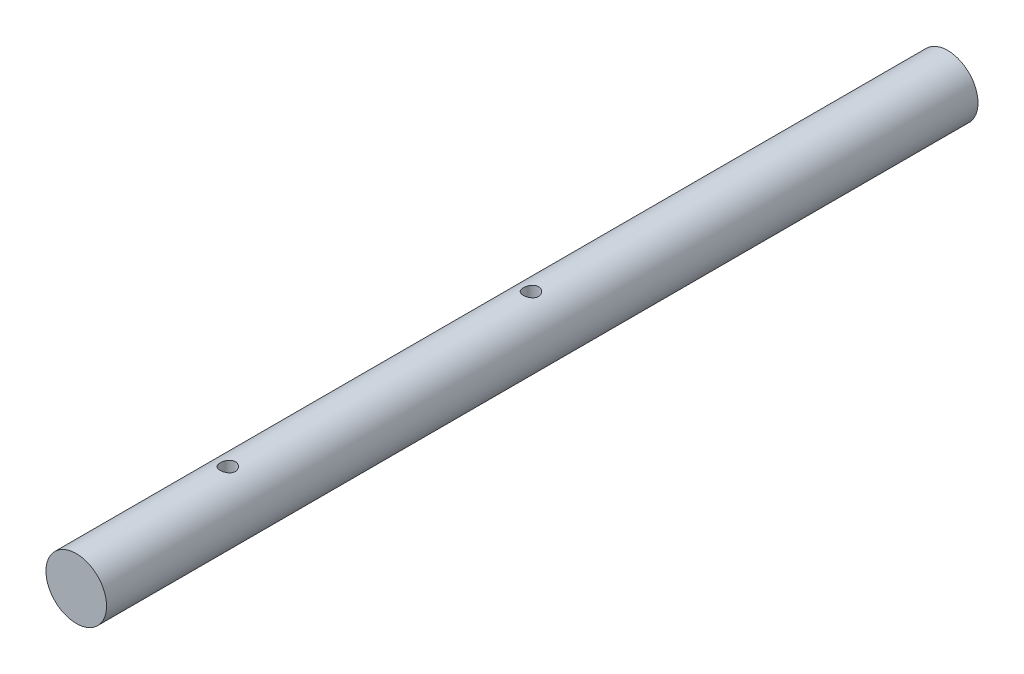
ISO-10303-21;
HEADER;
FILE_DESCRIPTION(('STEP AP214'),'2;1');
FILE_NAME('part.step','',(''),(''),'','','');
FILE_SCHEMA(('AUTOMOTIVE_DESIGN { 1 0 10303 214 1 1 1 1 }'));
ENDSEC;
DATA;
#1=APPLICATION_CONTEXT('core data for automotive mechanical design processes');
#2=APPLICATION_PROTOCOL_DEFINITION('international standard','automotive_design',2000,#1);
#3=PRODUCT_CONTEXT('',#1,'mechanical');
#4=PRODUCT('Part','Part','',(#3));
#5=PRODUCT_RELATED_PRODUCT_CATEGORY('part','',(#4));
#6=PRODUCT_DEFINITION_FORMATION('','',#4);
#7=PRODUCT_DEFINITION_CONTEXT('part definition',#1,'design');
#8=PRODUCT_DEFINITION('design','',#6,#7);
#9=PRODUCT_DEFINITION_SHAPE('','',#8);
#10=(LENGTH_UNIT() NAMED_UNIT(*) SI_UNIT(.MILLI.,.METRE.));
#11=(NAMED_UNIT(*) PLANE_ANGLE_UNIT() SI_UNIT($,.RADIAN.));
#12=(NAMED_UNIT(*) SI_UNIT($,.STERADIAN.) SOLID_ANGLE_UNIT());
#13=UNCERTAINTY_MEASURE_WITH_UNIT(LENGTH_MEASURE(1.E-05),#10,'distance_accuracy_value','');
#14=(GEOMETRIC_REPRESENTATION_CONTEXT(3) GLOBAL_UNCERTAINTY_ASSIGNED_CONTEXT((#13)) GLOBAL_UNIT_ASSIGNED_CONTEXT((#10,
#11,#12)) REPRESENTATION_CONTEXT('',''));
#15=CARTESIAN_POINT('',(0.,0.,0.));
#16=DIRECTION('',(0.,0.,1.));
#17=DIRECTION('',(1.,0.,0.));
#18=AXIS2_PLACEMENT_3D('',#15,#16,#17);
#19=CARTESIAN_POINT('',(-17.8140607084461,40.7356493123209,230.));
#20=DIRECTION('',(0.,0.,-1.));
#21=DIRECTION('',(-1.,0.,0.));
#22=AXIS2_PLACEMENT_3D('',#19,#20,#21);
#23=CYLINDRICAL_SURFACE('',#22,8.);
#24=CARTESIAN_POINT('',(-17.8140607084461,40.7356493123209,230.));
#25=DIRECTION('',(0.,0.,1.));
#26=DIRECTION('',(1.,0.,0.));
#27=AXIS2_PLACEMENT_3D('',#24,#25,#26);
#28=CIRCLE('',#27,8.);
#29=CARTESIAN_POINT('',(-9.81406070844613,40.7356493123209,230.));
#30=VERTEX_POINT('',#29);
#31=EDGE_CURVE('E12',#30,#30,#28,.T.);
#32=ORIENTED_EDGE('',*,*,#31,.F.);
#33=EDGE_LOOP('',(#32));
#34=FACE_BOUND('',#33,.T.);
#35=CARTESIAN_POINT('',(-17.8140607084461,40.7356493123209,0.));
#36=DIRECTION('',(0.,0.,1.));
#37=DIRECTION('',(1.,0.,0.));
#38=AXIS2_PLACEMENT_3D('',#35,#36,#37);
#39=CIRCLE('',#38,8.);
#40=CARTESIAN_POINT('',(-9.81406070844613,40.7356493123209,0.));
#41=VERTEX_POINT('',#40);
#42=EDGE_CURVE('E55',#41,#41,#39,.T.);
#43=ORIENTED_EDGE('',*,*,#42,.T.);
#44=EDGE_LOOP('',(#43));
#45=FACE_BOUND('',#44,.T.);
#46=CARTESIAN_POINT('',(-17.8140607084461,32.7356493123209,188.));
#47=CARTESIAN_POINT('',(-17.7035592568865,32.7356511807474,188.000003100984));
#48=CARTESIAN_POINT('',(-17.5930231646718,32.7379616038965,188.009188734365));
#49=CARTESIAN_POINT('',(-17.3751189434187,32.7469544612556,188.045633535076));
#50=CARTESIAN_POINT('',(-17.2677526459518,32.7536393733879,188.07290294605));
#51=CARTESIAN_POINT('',(-17.0593662122027,32.7706409612271,188.144585671283));
#52=CARTESIAN_POINT('',(-16.9583386238728,32.7809532744268,188.188978398287));
#53=CARTESIAN_POINT('',(-16.7651645325735,32.8041113948859,188.293575186726));
#54=CARTESIAN_POINT('',(-16.6730183293144,32.8169572875988,188.353779781492));
#55=CARTESIAN_POINT('',(-16.4983248053782,32.844083797765,188.489601052872));
#56=CARTESIAN_POINT('',(-16.4159864550314,32.8583865503459,188.565482099945));
#57=CARTESIAN_POINT('',(-16.2650621388417,32.8866677107484,188.729936273212));
#58=CARTESIAN_POINT('',(-16.1964777258472,32.9006460817893,188.818510830596));
#59=CARTESIAN_POINT('',(-16.0740253180475,32.9269189696786,189.007460302316));
#60=CARTESIAN_POINT('',(-16.0203910872126,32.9391853861234,189.107990974412));
#61=CARTESIAN_POINT('',(-15.9308648303785,32.9603227147473,189.316997882213));
#62=CARTESIAN_POINT('',(-15.8949699678593,32.9691941697286,189.425472844443));
#63=CARTESIAN_POINT('',(-15.8426542593731,32.9823096230366,189.644991330936));
#64=CARTESIAN_POINT('',(-15.8258576840034,32.9866427656941,189.755939861384));
#65=CARTESIAN_POINT('',(-15.8110450083576,32.9904578128597,189.979158091999));
#66=CARTESIAN_POINT('',(-15.8130258526886,32.9899405066152,190.091427574256));
#67=CARTESIAN_POINT('',(-15.8354120089265,32.9841932387633,190.311221076994));
#68=CARTESIAN_POINT('',(-15.8553695881919,32.979077805557,190.418794161954));
#69=CARTESIAN_POINT('',(-15.9124284592421,32.9648931833733,190.629014734548));
#70=CARTESIAN_POINT('',(-15.9495309723536,32.955823712731,190.731661870705));
#71=CARTESIAN_POINT('',(-16.0402080711965,32.9346477935788,190.930317355003));
#72=CARTESIAN_POINT('',(-16.0939451521356,32.9225116127233,191.026248229053));
#73=CARTESIAN_POINT('',(-16.2162523404262,32.896586501041,191.207891613009));
#74=CARTESIAN_POINT('',(-16.2848250433677,32.8827972811925,191.293602330756));
#75=CARTESIAN_POINT('',(-16.4371761422045,32.854637571789,191.454938154259));
#76=CARTESIAN_POINT('',(-16.521332364225,32.8402617192809,191.530205986748));
#77=CARTESIAN_POINT('',(-16.7012448184412,32.8129031046041,191.665628323285));
#78=CARTESIAN_POINT('',(-16.7970014048355,32.7999203849954,191.725782365685));
#79=CARTESIAN_POINT('',(-16.9979061902043,32.7767462177317,191.829400781633));
#80=CARTESIAN_POINT('',(-17.1030855175013,32.7665645106179,191.872807120339));
#81=CARTESIAN_POINT('',(-17.3195593642556,32.750210419102,191.941223074279));
#82=CARTESIAN_POINT('',(-17.4308527095788,32.7440372677971,191.966236208558));
#83=CARTESIAN_POINT('',(-17.6533407479261,32.7365093220359,191.996610087412));
#84=CARTESIAN_POINT('',(-17.7644650817952,32.7350352655438,192.0024573681));
#85=CARTESIAN_POINT('',(-17.9861045415148,32.7367319147949,191.995667997259));
#86=CARTESIAN_POINT('',(-18.0966197213056,32.7399022024296,191.983033009601));
#87=CARTESIAN_POINT('',(-18.3122130668148,32.7504548972895,191.940038788811));
#88=CARTESIAN_POINT('',(-18.4173475337378,32.7577741898434,191.909944982031));
#89=CARTESIAN_POINT('',(-18.6210704317161,32.7757998905324,191.833190554629));
#90=CARTESIAN_POINT('',(-18.7196582004896,32.7865066407223,191.786528260916));
#91=CARTESIAN_POINT('',(-18.9094248876859,32.8104052066367,191.677018494834));
#92=CARTESIAN_POINT('',(-19.0004412975606,32.8236377474284,191.613898516804));
#93=CARTESIAN_POINT('',(-19.1707628599705,32.8510558564886,191.473613454937));
#94=CARTESIAN_POINT('',(-19.2500659870768,32.8652415889648,191.396445947177));
#95=CARTESIAN_POINT('',(-19.3967147992098,32.8933965528439,191.227997385541));
#96=CARTESIAN_POINT('',(-19.4637191986088,32.9073519231571,191.136416395997));
#97=CARTESIAN_POINT('',(-19.5814083871297,32.9330776006244,190.943023154046));
#98=CARTESIAN_POINT('',(-19.6320939006567,32.9448480047605,190.841211356054));
#99=CARTESIAN_POINT('',(-19.7153292692585,32.9647413825253,190.630792370116));
#100=CARTESIAN_POINT('',(-19.7479865706516,32.9728859084288,190.522229828875));
#101=CARTESIAN_POINT('',(-19.7945215883845,32.9846260577851,190.300920482814));
#102=CARTESIAN_POINT('',(-19.808403411751,32.9882226760551,190.188174598623));
#103=CARTESIAN_POINT('',(-19.8167788288915,32.9903839629348,189.965171968193));
#104=CARTESIAN_POINT('',(-19.8118179054863,32.9890902092774,189.854936753167));
#105=CARTESIAN_POINT('',(-19.78389707953,32.981943858883,189.636928148443));
#106=CARTESIAN_POINT('',(-19.7609375386952,32.9760913537628,189.529154709315));
#107=CARTESIAN_POINT('',(-19.6979691343699,32.9605658365512,189.319722054579));
#108=CARTESIAN_POINT('',(-19.6580625813533,32.9509157758367,189.21803025968));
#109=CARTESIAN_POINT('',(-19.5624139265862,32.9288792359898,189.022712823048));
#110=CARTESIAN_POINT('',(-19.5066696284917,32.9164923773772,188.929088302417));
#111=CARTESIAN_POINT('',(-19.379217706629,32.8899741888074,188.749927161331));
#112=CARTESIAN_POINT('',(-19.3071315923291,32.8758057812308,188.664665235435));
#113=CARTESIAN_POINT('',(-19.1497798700324,32.8475422823704,188.507270606939));
#114=CARTESIAN_POINT('',(-19.0645111367943,32.8334472092934,188.435141026516));
#115=CARTESIAN_POINT('',(-18.8813508240496,32.8066139036854,188.304784921914));
#116=CARTESIAN_POINT('',(-18.783258604868,32.7939048674426,188.246833848438));
#117=CARTESIAN_POINT('',(-18.5784154544601,32.771583645986,188.148336716079));
#118=CARTESIAN_POINT('',(-18.4716707930285,32.7619692429905,188.107778185802));
#119=CARTESIAN_POINT('',(-18.2732743794374,32.748341851447,188.05123755956));
#120=CARTESIAN_POINT('',(-18.1825676029902,32.7436148449517,188.032065009262));
#121=CARTESIAN_POINT('',(-17.9992688038278,32.7372679092282,188.006445408504));
#122=CARTESIAN_POINT('',(-17.9066769234363,32.7356477463089,187.999997400926));
#123=CARTESIAN_POINT('',(-17.8140607084461,32.7356493123209,188.));
#124=B_SPLINE_CURVE_WITH_KNOTS('',3,(#46,#47,#48,#49,#50,#51,#52,#53,#54,#55,#56,#57,#58,#59,
#60,#61,#62,#63,#64,#65,#66,#67,#68,#69,#70,#71,#72,#73,#74,#75,#76,#77,#78,#79,#80,#81,#82,#83,
#84,#85,#86,#87,#88,#89,#90,#91,#92,#93,#94,#95,#96,#97,#98,#99,#100,#101,#102,#103,#104,#105,
#106,#107,#108,#109,#110,#111,#112,#113,#114,#115,#116,#117,#118,#119,#120,#121,#122,#123),
.UNSPECIFIED.,.T.,.F.,(4,2,2,2,2,2,2,2,2,2,2,2,2,2,2,2,2,2,2,2,2,2,2,2,2,2,2,2,2,2,2,2,2,2,2,2,
2,2,4),(0.,0.331164949962527,0.662517650351869,0.993473203048152,1.32443992022577,
1.66152580582854,1.99864972773417,2.34078196727745,2.68285948225828,3.01808393468097,
3.35325384154692,3.68029996013788,4.00736937959147,4.33774037169601,4.66816921119315,
5.00802001296456,5.34788119415426,5.68890972016583,6.02987298255954,6.36211078603465,
6.69431868154755,7.02160366023148,7.34892169767485,7.682047834249,8.0152315068179,
8.35659345610402,8.69794025003778,9.03723006156481,9.37644564340978,9.70591707202587,
10.0353818794581,10.362885340837,10.6904342418697,11.0265276855098,11.3627009303166,
11.7049624733722,12.046978184329,12.324563239273,12.6021274139515),.UNSPECIFIED.);
#125=CARTESIAN_POINT('',(-17.8140607084461,32.7356493123209,188.));
#126=VERTEX_POINT('',#125);
#127=EDGE_CURVE('E62',#126,#126,#124,.T.);
#128=ORIENTED_EDGE('',*,*,#127,.F.);
#129=EDGE_LOOP('',(#128));
#130=FACE_BOUND('',#129,.T.);
#131=CARTESIAN_POINT('',(-17.8140607084461,48.7356493123209,188.));
#132=CARTESIAN_POINT('',(-17.9245621600058,48.7356474438944,188.000003100984));
#133=CARTESIAN_POINT('',(-18.0350982522205,48.7333370207452,188.009188734365));
#134=CARTESIAN_POINT('',(-18.2530024734735,48.7243441633861,188.045633535076));
#135=CARTESIAN_POINT('',(-18.3603687709405,48.7176592512539,188.07290294605));
#136=CARTESIAN_POINT('',(-18.5687552046896,48.7006576634146,188.144585671283));
#137=CARTESIAN_POINT('',(-18.6697827930195,48.690345350215,188.188978398287));
#138=CARTESIAN_POINT('',(-18.8629568843187,48.6671872297558,188.293575186726));
#139=CARTESIAN_POINT('',(-18.9551030875778,48.654341337043,188.353779781492));
#140=CARTESIAN_POINT('',(-19.129796611514,48.6272148268768,188.489601052872));
#141=CARTESIAN_POINT('',(-19.2121349618609,48.6129120742959,188.565482099945));
#142=CARTESIAN_POINT('',(-19.3630592780506,48.5846309138934,188.729936273212));
#143=CARTESIAN_POINT('',(-19.4316436910451,48.5706525428524,188.818510830596));
#144=CARTESIAN_POINT('',(-19.5540960988448,48.5443796549631,189.007460302316));
#145=CARTESIAN_POINT('',(-19.6077303296797,48.5321132385184,189.107990974412));
#146=CARTESIAN_POINT('',(-19.6972565865138,48.5109759098944,189.316997882213));
#147=CARTESIAN_POINT('',(-19.733151449033,48.5021044549131,189.425472844443));
#148=CARTESIAN_POINT('',(-19.7854671575192,48.4889890016052,189.644991330936));
#149=CARTESIAN_POINT('',(-19.8022637328889,48.4846558589477,189.755939861384));
#150=CARTESIAN_POINT('',(-19.8170764085347,48.4808408117821,189.979158091999));
#151=CARTESIAN_POINT('',(-19.8150955642036,48.4813581180266,190.091427574256));
#152=CARTESIAN_POINT('',(-19.7927094079657,48.4871053858784,190.311221076994));
#153=CARTESIAN_POINT('',(-19.7727518287003,48.4922208190848,190.418794161954));
#154=CARTESIAN_POINT('',(-19.7156929576501,48.5064054412685,190.629014734548));
#155=CARTESIAN_POINT('',(-19.6785904445387,48.5154749119107,190.731661870705));
#156=CARTESIAN_POINT('',(-19.5879133456957,48.536650831063,190.930317355003));
#157=CARTESIAN_POINT('',(-19.5341762647567,48.5487870119184,191.026248229053));
#158=CARTESIAN_POINT('',(-19.4118690764661,48.5747121236008,191.207891613009));
#159=CARTESIAN_POINT('',(-19.3432963735246,48.5885013434493,191.293602330756));
#160=CARTESIAN_POINT('',(-19.1909452746877,48.6166610528528,191.454938154259));
#161=CARTESIAN_POINT('',(-19.1067890526673,48.6310369053609,191.530205986748));
#162=CARTESIAN_POINT('',(-18.9268765984511,48.6583955200376,191.665628323285));
#163=CARTESIAN_POINT('',(-18.8311200120567,48.6713782396463,191.725782365685));
#164=CARTESIAN_POINT('',(-18.630215226688,48.6945524069101,191.829400781633));
#165=CARTESIAN_POINT('',(-18.525035899391,48.7047341140239,191.872807120339));
#166=CARTESIAN_POINT('',(-18.3085620526366,48.7210882055398,191.941223074279));
#167=CARTESIAN_POINT('',(-18.1972687073134,48.7272613568446,191.966236208558));
#168=CARTESIAN_POINT('',(-17.9747806689662,48.7347893026059,191.996610087412));
#169=CARTESIAN_POINT('',(-17.8636563350971,48.7362633590979,192.0024573681));
#170=CARTESIAN_POINT('',(-17.6420168753775,48.7345667098469,191.995667997259));
#171=CARTESIAN_POINT('',(-17.5315016955867,48.7313964222122,191.983033009601));
#172=CARTESIAN_POINT('',(-17.3159083500775,48.7208437273523,191.940038788811));
#173=CARTESIAN_POINT('',(-17.2107738831544,48.7135244347984,191.909944982031));
#174=CARTESIAN_POINT('',(-17.0070509851761,48.6954987341093,191.833190554629));
#175=CARTESIAN_POINT('',(-16.9084632164026,48.6847919839194,191.786528260916));
#176=CARTESIAN_POINT('',(-16.7186965292063,48.660893418005,191.677018494834));
#177=CARTESIAN_POINT('',(-16.6276801193317,48.6476608772133,191.613898516804));
#178=CARTESIAN_POINT('',(-16.4573585569218,48.6202427681531,191.473613454937));
#179=CARTESIAN_POINT('',(-16.3780554298154,48.6060570356769,191.396445947177));
#180=CARTESIAN_POINT('',(-16.2314066176825,48.5779020717978,191.227997385541));
#181=CARTESIAN_POINT('',(-16.1644022182834,48.5639467014846,191.136416395997));
#182=CARTESIAN_POINT('',(-16.0467130297625,48.5382210240174,190.943023154046));
#183=CARTESIAN_POINT('',(-15.9960275162355,48.5264506198812,190.841211356054));
#184=CARTESIAN_POINT('',(-15.9127921476337,48.5065572421164,190.630792370116));
#185=CARTESIAN_POINT('',(-15.8801348462407,48.4984127162129,190.522229828875));
#186=CARTESIAN_POINT('',(-15.8335998285077,48.4866725668566,190.300920482814));
#187=CARTESIAN_POINT('',(-15.8197180051412,48.4830759485867,190.188174598623));
#188=CARTESIAN_POINT('',(-15.8113425880008,48.480914661707,189.965171968193));
#189=CARTESIAN_POINT('',(-15.816303511406,48.4822084153644,189.854936753167));
#190=CARTESIAN_POINT('',(-15.8442243373623,48.4893547657588,189.636928148443));
#191=CARTESIAN_POINT('',(-15.8671838781971,48.495207270879,189.529154709315));
#192=CARTESIAN_POINT('',(-15.9301522825224,48.5107327880905,189.319722054579));
#193=CARTESIAN_POINT('',(-15.970058835539,48.520382848805,189.21803025968));
#194=CARTESIAN_POINT('',(-16.065707490306,48.5424193886519,189.022712823048));
#195=CARTESIAN_POINT('',(-16.1214517884005,48.5548062472645,188.929088302417));
#196=CARTESIAN_POINT('',(-16.2489037102633,48.5813244358344,188.749927161331));
#197=CARTESIAN_POINT('',(-16.3209898245631,48.595492843411,188.664665235435));
#198=CARTESIAN_POINT('',(-16.4783415468598,48.6237563422713,188.507270606939));
#199=CARTESIAN_POINT('',(-16.5636102800979,48.6378514153483,188.435141026516));
#200=CARTESIAN_POINT('',(-16.7467705928427,48.6646847209564,188.304784921914));
#201=CARTESIAN_POINT('',(-16.8448628120243,48.6773937571991,188.246833848438));
#202=CARTESIAN_POINT('',(-17.0497059624322,48.6997149786558,188.148336716079));
#203=CARTESIAN_POINT('',(-17.1564506238638,48.7093293816513,188.107778185802));
#204=CARTESIAN_POINT('',(-17.3548470374548,48.7229567731948,188.05123755956));
#205=CARTESIAN_POINT('',(-17.445553813902,48.7276837796901,188.032065009262));
#206=CARTESIAN_POINT('',(-17.6288526130644,48.7340307154135,188.006445408504));
#207=CARTESIAN_POINT('',(-17.721444493456,48.7356508783328,187.999997400926));
#208=CARTESIAN_POINT('',(-17.8140607084461,48.7356493123209,188.));
#209=B_SPLINE_CURVE_WITH_KNOTS('',3,(#131,#132,#133,#134,#135,#136,#137,#138,#139,#140,#141,
#142,#143,#144,#145,#146,#147,#148,#149,#150,#151,#152,#153,#154,#155,#156,#157,#158,#159,#160,
#161,#162,#163,#164,#165,#166,#167,#168,#169,#170,#171,#172,#173,#174,#175,#176,#177,#178,#179,
#180,#181,#182,#183,#184,#185,#186,#187,#188,#189,#190,#191,#192,#193,#194,#195,#196,#197,#198,
#199,#200,#201,#202,#203,#204,#205,#206,#207,#208),.UNSPECIFIED.,.T.,.F.,(4,2,2,2,2,2,2,2,2,2,2,
2,2,2,2,2,2,2,2,2,2,2,2,2,2,2,2,2,2,2,2,2,2,2,2,2,2,2,4),(0.,0.331164949962527,
0.662517650351869,0.993473203048156,1.32443992022577,1.66152580582854,1.99864972773417,
2.34078196727745,2.68285948225828,3.01808393468097,3.35325384154692,3.68029996013788,
4.00736937959147,4.33774037169601,4.66816921119315,5.00802001296456,5.34788119415426,
5.68890972016584,6.02987298255954,6.36211078603465,6.69431868154755,7.02160366023149,
7.34892169767485,7.682047834249,8.0152315068179,8.356593456104,8.69794025003778,
9.03723006156481,9.37644564340978,9.70591707202587,10.0353818794581,10.362885340837,
10.6904342418697,11.0265276855098,11.3627009303166,11.7049624733722,12.046978184329,
12.324563239273,12.6021274139515),.UNSPECIFIED.);
#210=CARTESIAN_POINT('',(-17.8140607084461,48.7356493123209,188.));
#211=VERTEX_POINT('',#210);
#212=EDGE_CURVE('E68',#211,#211,#209,.T.);
#213=ORIENTED_EDGE('',*,*,#212,.F.);
#214=EDGE_LOOP('',(#213));
#215=FACE_BOUND('',#214,.T.);
#216=CARTESIAN_POINT('',(-17.8140607084461,32.7356493123209,108.));
#217=CARTESIAN_POINT('',(-17.7035592568865,32.7356511807474,108.000003100984));
#218=CARTESIAN_POINT('',(-17.5930231646718,32.7379616038965,108.009188734365));
#219=CARTESIAN_POINT('',(-17.3751189434188,32.7469544612556,108.045633535076));
#220=CARTESIAN_POINT('',(-17.2677526459518,32.7536393733879,108.07290294605));
#221=CARTESIAN_POINT('',(-17.0593662122027,32.7706409612271,108.144585671283));
#222=CARTESIAN_POINT('',(-16.9583386238728,32.7809532744268,108.188978398287));
#223=CARTESIAN_POINT('',(-16.7651645325736,32.8041113948859,108.293575186726));
#224=CARTESIAN_POINT('',(-16.6730183293144,32.8169572875988,108.353779781492));
#225=CARTESIAN_POINT('',(-16.4983248053782,32.844083797765,108.489601052872));
#226=CARTESIAN_POINT('',(-16.4159864550314,32.8583865503459,108.565482099945));
#227=CARTESIAN_POINT('',(-16.2650621388417,32.8866677107484,108.729936273212));
#228=CARTESIAN_POINT('',(-16.1964777258472,32.9006460817893,108.818510830596));
#229=CARTESIAN_POINT('',(-16.0740253180475,32.9269189696786,109.007460302316));
#230=CARTESIAN_POINT('',(-16.0203910872126,32.9391853861234,109.107990974412));
#231=CARTESIAN_POINT('',(-15.9308648303785,32.9603227147473,109.316997882213));
#232=CARTESIAN_POINT('',(-15.8949699678593,32.9691941697286,109.425472844443));
#233=CARTESIAN_POINT('',(-15.8426542593731,32.9823096230366,109.644991330936));
#234=CARTESIAN_POINT('',(-15.8258576840034,32.9866427656941,109.755939861384));
#235=CARTESIAN_POINT('',(-15.8110450083576,32.9904578128597,109.979158091999));
#236=CARTESIAN_POINT('',(-15.8130258526886,32.9899405066152,110.091427574256));
#237=CARTESIAN_POINT('',(-15.8354120089265,32.9841932387633,110.311221076994));
#238=CARTESIAN_POINT('',(-15.855369588192,32.979077805557,110.418794161954));
#239=CARTESIAN_POINT('',(-15.9124284592421,32.9648931833733,110.629014734548));
#240=CARTESIAN_POINT('',(-15.9495309723536,32.955823712731,110.731661870705));
#241=CARTESIAN_POINT('',(-16.0402080711966,32.9346477935788,110.930317355003));
#242=CARTESIAN_POINT('',(-16.0939451521356,32.9225116127233,111.026248229053));
#243=CARTESIAN_POINT('',(-16.2162523404262,32.896586501041,111.207891613009));
#244=CARTESIAN_POINT('',(-16.2848250433677,32.8827972811925,111.293602330756));
#245=CARTESIAN_POINT('',(-16.4371761422045,32.854637571789,111.454938154259));
#246=CARTESIAN_POINT('',(-16.521332364225,32.8402617192809,111.530205986748));
#247=CARTESIAN_POINT('',(-16.7012448184412,32.8129031046041,111.665628323285));
#248=CARTESIAN_POINT('',(-16.7970014048355,32.7999203849954,111.725782365685));
#249=CARTESIAN_POINT('',(-16.9979061902043,32.7767462177317,111.829400781633));
#250=CARTESIAN_POINT('',(-17.1030855175013,32.7665645106178,111.872807120339));
#251=CARTESIAN_POINT('',(-17.3195593642556,32.750210419102,111.941223074279));
#252=CARTESIAN_POINT('',(-17.4308527095788,32.7440372677971,111.966236208558));
#253=CARTESIAN_POINT('',(-17.6533407479261,32.7365093220359,111.996610087412));
#254=CARTESIAN_POINT('',(-17.7644650817952,32.7350352655438,112.0024573681));
#255=CARTESIAN_POINT('',(-17.9861045415148,32.7367319147949,111.995667997259));
#256=CARTESIAN_POINT('',(-18.0966197213056,32.7399022024296,111.983033009601));
#257=CARTESIAN_POINT('',(-18.3122130668148,32.7504548972895,111.940038788811));
#258=CARTESIAN_POINT('',(-18.4173475337378,32.7577741898434,111.909944982031));
#259=CARTESIAN_POINT('',(-18.6210704317161,32.7757998905324,111.833190554629));
#260=CARTESIAN_POINT('',(-18.7196582004896,32.7865066407223,111.786528260916));
#261=CARTESIAN_POINT('',(-18.9094248876859,32.8104052066367,111.677018494834));
#262=CARTESIAN_POINT('',(-19.0004412975606,32.8236377474284,111.613898516804));
#263=CARTESIAN_POINT('',(-19.1707628599705,32.8510558564886,111.473613454937));
#264=CARTESIAN_POINT('',(-19.2500659870768,32.8652415889648,111.396445947177));
#265=CARTESIAN_POINT('',(-19.3967147992098,32.8933965528439,111.227997385541));
#266=CARTESIAN_POINT('',(-19.4637191986088,32.9073519231571,111.136416395997));
#267=CARTESIAN_POINT('',(-19.5814083871297,32.9330776006244,110.943023154046));
#268=CARTESIAN_POINT('',(-19.6320939006567,32.9448480047605,110.841211356054));
#269=CARTESIAN_POINT('',(-19.7153292692585,32.9647413825253,110.630792370116));
#270=CARTESIAN_POINT('',(-19.7479865706516,32.9728859084288,110.522229828875));
#271=CARTESIAN_POINT('',(-19.7945215883845,32.9846260577851,110.300920482814));
#272=CARTESIAN_POINT('',(-19.808403411751,32.9882226760551,110.188174598623));
#273=CARTESIAN_POINT('',(-19.8167788288915,32.9903839629348,109.965171968193));
#274=CARTESIAN_POINT('',(-19.8118179054863,32.9890902092774,109.854936753167));
#275=CARTESIAN_POINT('',(-19.78389707953,32.981943858883,109.636928148443));
#276=CARTESIAN_POINT('',(-19.7609375386952,32.9760913537628,109.529154709315));
#277=CARTESIAN_POINT('',(-19.6979691343699,32.9605658365512,109.319722054579));
#278=CARTESIAN_POINT('',(-19.6580625813533,32.9509157758368,109.21803025968));
#279=CARTESIAN_POINT('',(-19.5624139265862,32.9288792359898,109.022712823048));
#280=CARTESIAN_POINT('',(-19.5066696284917,32.9164923773772,108.929088302417));
#281=CARTESIAN_POINT('',(-19.379217706629,32.8899741888074,108.749927161331));
#282=CARTESIAN_POINT('',(-19.3071315923291,32.8758057812308,108.664665235435));
#283=CARTESIAN_POINT('',(-19.1497798700324,32.8475422823704,108.507270606939));
#284=CARTESIAN_POINT('',(-19.0645111367943,32.8334472092934,108.435141026516));
#285=CARTESIAN_POINT('',(-18.8813508240496,32.8066139036854,108.304784921914));
#286=CARTESIAN_POINT('',(-18.783258604868,32.7939048674426,108.246833848438));
#287=CARTESIAN_POINT('',(-18.5784154544601,32.771583645986,108.148336716079));
#288=CARTESIAN_POINT('',(-18.4716707930284,32.7619692429905,108.107778185802));
#289=CARTESIAN_POINT('',(-18.2732743794374,32.748341851447,108.05123755956));
#290=CARTESIAN_POINT('',(-18.1825676029902,32.7436148449517,108.032065009262));
#291=CARTESIAN_POINT('',(-17.9992688038278,32.7372679092282,108.006445408504));
#292=CARTESIAN_POINT('',(-17.9066769234363,32.7356477463089,107.999997400926));
#293=CARTESIAN_POINT('',(-17.8140607084461,32.7356493123209,108.));
#294=B_SPLINE_CURVE_WITH_KNOTS('',3,(#216,#217,#218,#219,#220,#221,#222,#223,#224,#225,#226,
#227,#228,#229,#230,#231,#232,#233,#234,#235,#236,#237,#238,#239,#240,#241,#242,#243,#244,#245,
#246,#247,#248,#249,#250,#251,#252,#253,#254,#255,#256,#257,#258,#259,#260,#261,#262,#263,#264,
#265,#266,#267,#268,#269,#270,#271,#272,#273,#274,#275,#276,#277,#278,#279,#280,#281,#282,#283,
#284,#285,#286,#287,#288,#289,#290,#291,#292,#293),.UNSPECIFIED.,.T.,.F.,(4,2,2,2,2,2,2,2,2,2,2,
2,2,2,2,2,2,2,2,2,2,2,2,2,2,2,2,2,2,2,2,2,2,2,2,2,2,2,4),(0.,0.33116494996252,0.662517650351869,
0.993473203048147,1.32443992022578,1.66152580582852,1.99864972773417,2.34078196727743,
2.68285948225825,3.01808393468094,3.35325384154693,3.68029996013787,4.00736937959148,
4.33774037169603,4.66816921119313,5.00802001296456,5.34788119415426,5.68890972016582,
6.02987298255953,6.36211078603464,6.69431868154753,7.02160366023146,7.34892169767484,
7.68204783424898,8.01523150681788,8.35659345610398,8.69794025003775,9.03723006156479,
9.37644564340974,9.7059170720258,10.0353818794581,10.3628853408369,10.6904342418697,
11.0265276855098,11.3627009303165,11.7049624733721,12.046978184329,12.324563239273,
12.6021274139515),.UNSPECIFIED.);
#295=CARTESIAN_POINT('',(-17.8140607084461,32.7356493123209,108.));
#296=VERTEX_POINT('',#295);
#297=EDGE_CURVE('E102',#296,#296,#294,.T.);
#298=ORIENTED_EDGE('',*,*,#297,.F.);
#299=EDGE_LOOP('',(#298));
#300=FACE_BOUND('',#299,.T.);
#301=CARTESIAN_POINT('',(-17.8140607084461,48.7356493123209,108.));
#302=CARTESIAN_POINT('',(-17.9245621600058,48.7356474438944,108.000003100984));
#303=CARTESIAN_POINT('',(-18.0350982522205,48.7333370207452,108.009188734365));
#304=CARTESIAN_POINT('',(-18.2530024734735,48.7243441633861,108.045633535076));
#305=CARTESIAN_POINT('',(-18.3603687709405,48.7176592512539,108.07290294605));
#306=CARTESIAN_POINT('',(-18.5687552046896,48.7006576634146,108.144585671283));
#307=CARTESIAN_POINT('',(-18.6697827930195,48.690345350215,108.188978398287));
#308=CARTESIAN_POINT('',(-18.8629568843187,48.6671872297558,108.293575186726));
#309=CARTESIAN_POINT('',(-18.9551030875778,48.654341337043,108.353779781492));
#310=CARTESIAN_POINT('',(-19.129796611514,48.6272148268768,108.489601052872));
#311=CARTESIAN_POINT('',(-19.2121349618609,48.6129120742959,108.565482099945));
#312=CARTESIAN_POINT('',(-19.3630592780506,48.5846309138934,108.729936273212));
#313=CARTESIAN_POINT('',(-19.4316436910451,48.5706525428524,108.818510830596));
#314=CARTESIAN_POINT('',(-19.5540960988448,48.5443796549631,109.007460302316));
#315=CARTESIAN_POINT('',(-19.6077303296796,48.5321132385184,109.107990974412));
#316=CARTESIAN_POINT('',(-19.6972565865138,48.5109759098944,109.316997882213));
#317=CARTESIAN_POINT('',(-19.733151449033,48.5021044549131,109.425472844443));
#318=CARTESIAN_POINT('',(-19.7854671575192,48.4889890016052,109.644991330936));
#319=CARTESIAN_POINT('',(-19.8022637328889,48.4846558589477,109.755939861384));
#320=CARTESIAN_POINT('',(-19.8170764085347,48.4808408117821,109.979158091999));
#321=CARTESIAN_POINT('',(-19.8150955642036,48.4813581180266,110.091427574256));
#322=CARTESIAN_POINT('',(-19.7927094079657,48.4871053858784,110.311221076994));
#323=CARTESIAN_POINT('',(-19.7727518287003,48.4922208190848,110.418794161954));
#324=CARTESIAN_POINT('',(-19.7156929576501,48.5064054412685,110.629014734548));
#325=CARTESIAN_POINT('',(-19.6785904445386,48.5154749119107,110.731661870705));
#326=CARTESIAN_POINT('',(-19.5879133456957,48.536650831063,110.930317355003));
#327=CARTESIAN_POINT('',(-19.5341762647567,48.5487870119184,111.026248229053));
#328=CARTESIAN_POINT('',(-19.4118690764661,48.5747121236008,111.207891613009));
#329=CARTESIAN_POINT('',(-19.3432963735246,48.5885013434493,111.293602330756));
#330=CARTESIAN_POINT('',(-19.1909452746877,48.6166610528528,111.454938154259));
#331=CARTESIAN_POINT('',(-19.1067890526673,48.6310369053609,111.530205986748));
#332=CARTESIAN_POINT('',(-18.9268765984511,48.6583955200376,111.665628323285));
#333=CARTESIAN_POINT('',(-18.8311200120567,48.6713782396463,111.725782365685));
#334=CARTESIAN_POINT('',(-18.630215226688,48.6945524069101,111.829400781633));
#335=CARTESIAN_POINT('',(-18.525035899391,48.7047341140239,111.872807120339));
#336=CARTESIAN_POINT('',(-18.3085620526366,48.7210882055398,111.941223074279));
#337=CARTESIAN_POINT('',(-18.1972687073134,48.7272613568446,111.966236208558));
#338=CARTESIAN_POINT('',(-17.9747806689662,48.7347893026059,111.996610087412));
#339=CARTESIAN_POINT('',(-17.8636563350971,48.7362633590979,112.0024573681));
#340=CARTESIAN_POINT('',(-17.6420168753774,48.7345667098469,111.995667997259));
#341=CARTESIAN_POINT('',(-17.5315016955867,48.7313964222122,111.983033009601));
#342=CARTESIAN_POINT('',(-17.3159083500775,48.7208437273523,111.940038788811));
#343=CARTESIAN_POINT('',(-17.2107738831544,48.7135244347984,111.909944982031));
#344=CARTESIAN_POINT('',(-17.0070509851761,48.6954987341093,111.833190554629));
#345=CARTESIAN_POINT('',(-16.9084632164026,48.6847919839194,111.786528260916));
#346=CARTESIAN_POINT('',(-16.7186965292063,48.660893418005,111.677018494834));
#347=CARTESIAN_POINT('',(-16.6276801193317,48.6476608772133,111.613898516804));
#348=CARTESIAN_POINT('',(-16.4573585569218,48.6202427681531,111.473613454937));
#349=CARTESIAN_POINT('',(-16.3780554298154,48.6060570356769,111.396445947177));
#350=CARTESIAN_POINT('',(-16.2314066176825,48.5779020717978,111.227997385541));
#351=CARTESIAN_POINT('',(-16.1644022182834,48.5639467014846,111.136416395997));
#352=CARTESIAN_POINT('',(-16.0467130297625,48.5382210240174,110.943023154046));
#353=CARTESIAN_POINT('',(-15.9960275162355,48.5264506198812,110.841211356054));
#354=CARTESIAN_POINT('',(-15.9127921476337,48.5065572421164,110.630792370116));
#355=CARTESIAN_POINT('',(-15.8801348462407,48.4984127162129,110.522229828875));
#356=CARTESIAN_POINT('',(-15.8335998285078,48.4866725668566,110.300920482814));
#357=CARTESIAN_POINT('',(-15.8197180051412,48.4830759485867,110.188174598623));
#358=CARTESIAN_POINT('',(-15.8113425880008,48.480914661707,109.965171968193));
#359=CARTESIAN_POINT('',(-15.816303511406,48.4822084153644,109.854936753167));
#360=CARTESIAN_POINT('',(-15.8442243373623,48.4893547657588,109.636928148443));
#361=CARTESIAN_POINT('',(-15.8671838781971,48.495207270879,109.529154709315));
#362=CARTESIAN_POINT('',(-15.9301522825224,48.5107327880905,109.319722054579));
#363=CARTESIAN_POINT('',(-15.970058835539,48.520382848805,109.21803025968));
#364=CARTESIAN_POINT('',(-16.065707490306,48.5424193886519,109.022712823048));
#365=CARTESIAN_POINT('',(-16.1214517884005,48.5548062472645,108.929088302417));
#366=CARTESIAN_POINT('',(-16.2489037102633,48.5813244358344,108.749927161331));
#367=CARTESIAN_POINT('',(-16.3209898245631,48.595492843411,108.664665235435));
#368=CARTESIAN_POINT('',(-16.4783415468598,48.6237563422713,108.507270606939));
#369=CARTESIAN_POINT('',(-16.5636102800979,48.6378514153483,108.435141026516));
#370=CARTESIAN_POINT('',(-16.7467705928427,48.6646847209564,108.304784921914));
#371=CARTESIAN_POINT('',(-16.8448628120243,48.6773937571991,108.246833848438));
#372=CARTESIAN_POINT('',(-17.0497059624322,48.6997149786558,108.148336716079));
#373=CARTESIAN_POINT('',(-17.1564506238638,48.7093293816513,108.107778185802));
#374=CARTESIAN_POINT('',(-17.3548470374548,48.7229567731948,108.05123755956));
#375=CARTESIAN_POINT('',(-17.445553813902,48.7276837796901,108.032065009262));
#376=CARTESIAN_POINT('',(-17.6288526130644,48.7340307154135,108.006445408504));
#377=CARTESIAN_POINT('',(-17.721444493456,48.7356508783328,107.999997400926));
#378=CARTESIAN_POINT('',(-17.8140607084461,48.7356493123209,108.));
#379=B_SPLINE_CURVE_WITH_KNOTS('',3,(#301,#302,#303,#304,#305,#306,#307,#308,#309,#310,#311,
#312,#313,#314,#315,#316,#317,#318,#319,#320,#321,#322,#323,#324,#325,#326,#327,#328,#329,#330,
#331,#332,#333,#334,#335,#336,#337,#338,#339,#340,#341,#342,#343,#344,#345,#346,#347,#348,#349,
#350,#351,#352,#353,#354,#355,#356,#357,#358,#359,#360,#361,#362,#363,#364,#365,#366,#367,#368,
#369,#370,#371,#372,#373,#374,#375,#376,#377,#378),.UNSPECIFIED.,.T.,.F.,(4,2,2,2,2,2,2,2,2,2,2,
2,2,2,2,2,2,2,2,2,2,2,2,2,2,2,2,2,2,2,2,2,2,2,2,2,2,2,4),(0.,0.33116494996252,0.662517650351869,
0.99347320304814,1.32443992022578,1.66152580582852,1.99864972773416,2.34078196727743,
2.68285948225824,3.01808393468094,3.35325384154692,3.68029996013787,4.00736937959148,
4.33774037169603,4.66816921119313,5.00802001296456,5.34788119415426,5.68890972016582,
6.02987298255953,6.36211078603464,6.69431868154753,7.02160366023146,7.34892169767483,
7.68204783424898,8.01523150681788,8.35659345610397,8.69794025003774,9.03723006156479,
9.37644564340974,9.70591707202579,10.0353818794581,10.3628853408369,10.6904342418697,
11.0265276855098,11.3627009303165,11.7049624733721,12.046978184329,12.3245632392729,
12.6021274139515),.UNSPECIFIED.);
#380=CARTESIAN_POINT('',(-17.8140607084461,48.7356493123209,108.));
#381=VERTEX_POINT('',#380);
#382=EDGE_CURVE('E48',#381,#381,#379,.T.);
#383=ORIENTED_EDGE('',*,*,#382,.F.);
#384=EDGE_LOOP('',(#383));
#385=FACE_BOUND('',#384,.T.);
#386=ADVANCED_FACE('F44',(#34,#45,#130,#215,#300,#385),#23,.T.);
#387=CARTESIAN_POINT('',(-17.8140607084461,40.7356493123209,230.));
#388=DIRECTION('',(0.,0.,1.));
#389=DIRECTION('',(1.,0.,0.));
#390=AXIS2_PLACEMENT_3D('',#387,#388,#389);
#391=PLANE('',#390);
#392=ORIENTED_EDGE('',*,*,#31,.T.);
#393=EDGE_LOOP('',(#392));
#394=FACE_BOUND('',#393,.T.);
#395=ADVANCED_FACE('F79',(#394),#391,.T.);
#396=CARTESIAN_POINT('',(-17.8140607084461,40.7356493123209,0.));
#397=DIRECTION('',(0.,0.,1.));
#398=DIRECTION('',(1.,0.,0.));
#399=AXIS2_PLACEMENT_3D('',#396,#397,#398);
#400=PLANE('',#399);
#401=ORIENTED_EDGE('',*,*,#42,.F.);
#402=EDGE_LOOP('',(#401));
#403=FACE_BOUND('',#402,.T.);
#404=ADVANCED_FACE('F76',(#403),#400,.F.);
#405=CARTESIAN_POINT('',(-17.8140607084461,148.,190.));
#406=DIRECTION('',(0.,-1.,0.));
#407=DIRECTION('',(0.,0.,-1.));
#408=AXIS2_PLACEMENT_3D('',#405,#406,#407);
#409=CYLINDRICAL_SURFACE('',#408,2.00000000000001);
#410=ORIENTED_EDGE('',*,*,#127,.T.);
#411=EDGE_LOOP('',(#410));
#412=FACE_BOUND('',#411,.T.);
#413=ORIENTED_EDGE('',*,*,#212,.T.);
#414=EDGE_LOOP('',(#413));
#415=FACE_BOUND('',#414,.T.);
#416=ADVANCED_FACE('F71',(#412,#415),#409,.F.);
#417=CARTESIAN_POINT('',(-17.8140607084461,148.,110.));
#418=DIRECTION('',(0.,-1.,0.));
#419=DIRECTION('',(0.,0.,-1.));
#420=AXIS2_PLACEMENT_3D('',#417,#418,#419);
#421=CYLINDRICAL_SURFACE('',#420,2.);
#422=ORIENTED_EDGE('',*,*,#297,.T.);
#423=EDGE_LOOP('',(#422));
#424=FACE_BOUND('',#423,.T.);
#425=ORIENTED_EDGE('',*,*,#382,.T.);
#426=EDGE_LOOP('',(#425));
#427=FACE_BOUND('',#426,.T.);
#428=ADVANCED_FACE('F75',(#424,#427),#421,.F.);
#429=CLOSED_SHELL('',(#386,#395,#404,#416,#428));
#430=MANIFOLD_SOLID_BREP('B2',#429);
#431=ADVANCED_BREP_SHAPE_REPRESENTATION('',(#18,#430),#14);
#432=SHAPE_DEFINITION_REPRESENTATION(#9,#431);
ENDSEC;
END-ISO-10303-21;
